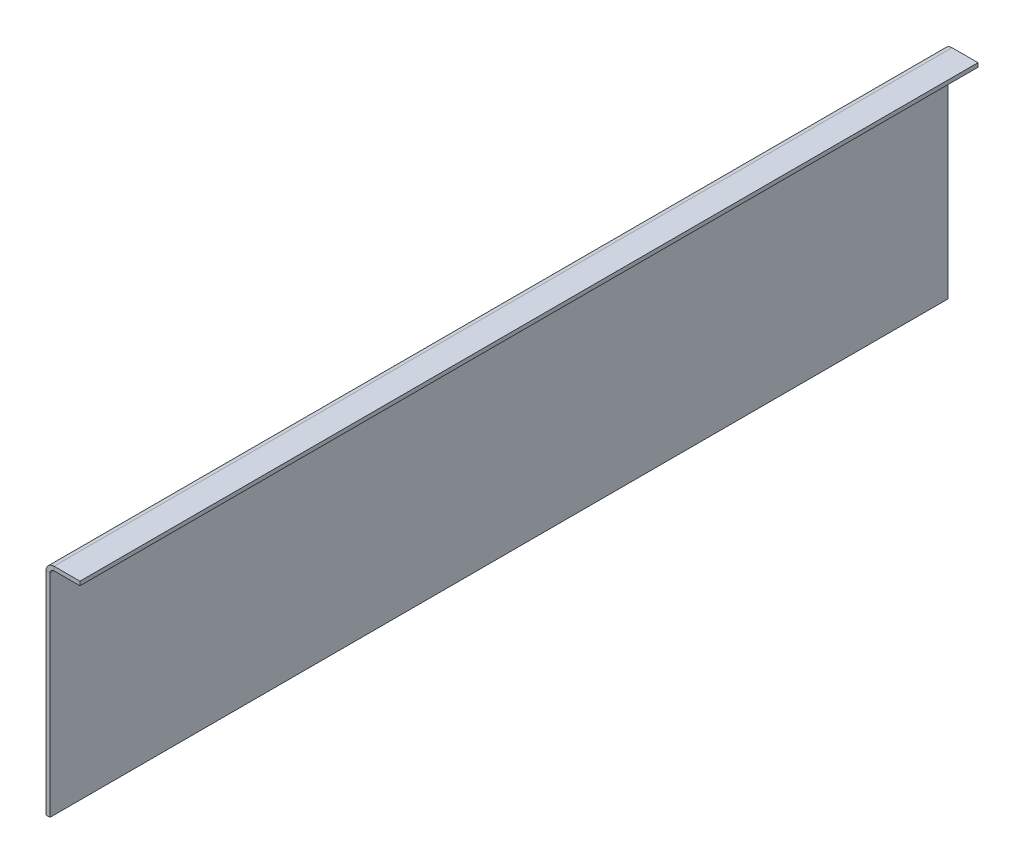
ISO-10303-21;
HEADER;
FILE_DESCRIPTION(('STEP AP214'),'2;1');
FILE_NAME('part.step','',(''),(''),'','','');
FILE_SCHEMA(('AUTOMOTIVE_DESIGN { 1 0 10303 214 1 1 1 1 }'));
ENDSEC;
DATA;
#1=APPLICATION_CONTEXT('core data for automotive mechanical design processes');
#2=APPLICATION_PROTOCOL_DEFINITION('international standard','automotive_design',2000,#1);
#3=PRODUCT_CONTEXT('',#1,'mechanical');
#4=PRODUCT('Part','Part','',(#3));
#5=PRODUCT_RELATED_PRODUCT_CATEGORY('part','',(#4));
#6=PRODUCT_DEFINITION_FORMATION('','',#4);
#7=PRODUCT_DEFINITION_CONTEXT('part definition',#1,'design');
#8=PRODUCT_DEFINITION('design','',#6,#7);
#9=PRODUCT_DEFINITION_SHAPE('','',#8);
#10=(LENGTH_UNIT() NAMED_UNIT(*) SI_UNIT(.MILLI.,.METRE.));
#11=(NAMED_UNIT(*) PLANE_ANGLE_UNIT() SI_UNIT($,.RADIAN.));
#12=(NAMED_UNIT(*) SI_UNIT($,.STERADIAN.) SOLID_ANGLE_UNIT());
#13=UNCERTAINTY_MEASURE_WITH_UNIT(LENGTH_MEASURE(1.E-05),#10,'distance_accuracy_value','');
#14=(GEOMETRIC_REPRESENTATION_CONTEXT(3) GLOBAL_UNCERTAINTY_ASSIGNED_CONTEXT((#13)) GLOBAL_UNIT_ASSIGNED_CONTEXT((#10,
#11,#12)) REPRESENTATION_CONTEXT('',''));
#15=CARTESIAN_POINT('',(0.,0.,0.));
#16=DIRECTION('',(0.,0.,1.));
#17=DIRECTION('',(1.,0.,0.));
#18=AXIS2_PLACEMENT_3D('',#15,#16,#17);
#19=CARTESIAN_POINT('',(17.,108.,-225.));
#20=DIRECTION('',(0.,0.,1.));
#21=DIRECTION('',(1.,0.,0.));
#22=AXIS2_PLACEMENT_3D('',#19,#20,#21);
#23=PLANE('',#22);
#24=DIRECTION('',(0.,-1.,0.));
#25=VECTOR('',#24,1.);
#26=CARTESIAN_POINT('',(3.99999999999998,108.,-225.));
#27=LINE('',#26,#25);
#28=CARTESIAN_POINT('',(3.99999999999998,110.,-225.));
#29=VERTEX_POINT('',#28);
#30=CARTESIAN_POINT('',(3.99999999999998,108.,-225.));
#31=VERTEX_POINT('',#30);
#32=EDGE_CURVE('E11',#29,#31,#27,.T.);
#33=ORIENTED_EDGE('',*,*,#32,.F.);
#34=DIRECTION('',(-1.,0.,0.));
#35=VECTOR('',#34,1.);
#36=CARTESIAN_POINT('',(17.,110.,-225.));
#37=LINE('',#36,#35);
#38=CARTESIAN_POINT('',(17.,110.,-225.));
#39=VERTEX_POINT('',#38);
#40=EDGE_CURVE('E95',#29,#39,#37,.F.);
#41=ORIENTED_EDGE('',*,*,#40,.T.);
#42=DIRECTION('',(0.,-1.,0.));
#43=VECTOR('',#42,1.);
#44=CARTESIAN_POINT('',(17.,108.,-225.));
#45=LINE('',#44,#43);
#46=CARTESIAN_POINT('',(17.,108.,-225.));
#47=VERTEX_POINT('',#46);
#48=EDGE_CURVE('E55',#39,#47,#45,.T.);
#49=ORIENTED_EDGE('',*,*,#48,.T.);
#50=DIRECTION('',(1.,0.,0.));
#51=VECTOR('',#50,1.);
#52=CARTESIAN_POINT('',(17.,108.,-225.));
#53=LINE('',#52,#51);
#54=EDGE_CURVE('E98',#31,#47,#53,.T.);
#55=ORIENTED_EDGE('',*,*,#54,.F.);
#56=EDGE_LOOP('',(#33,#41,#49,#55));
#57=FACE_BOUND('',#56,.T.);
#58=ADVANCED_FACE('F45',(#57),#23,.F.);
#59=CARTESIAN_POINT('',(17.,108.,225.));
#60=DIRECTION('',(1.,0.,0.));
#61=DIRECTION('',(0.,0.,-1.));
#62=AXIS2_PLACEMENT_3D('',#59,#60,#61);
#63=PLANE('',#62);
#64=ORIENTED_EDGE('',*,*,#48,.F.);
#65=DIRECTION('',(0.,0.,1.));
#66=VECTOR('',#65,1.);
#67=CARTESIAN_POINT('',(17.,110.,225.));
#68=LINE('',#67,#66);
#69=CARTESIAN_POINT('',(17.,110.,225.));
#70=VERTEX_POINT('',#69);
#71=EDGE_CURVE('E123',#70,#39,#68,.F.);
#72=ORIENTED_EDGE('',*,*,#71,.F.);
#73=DIRECTION('',(0.,-1.,0.));
#74=VECTOR('',#73,1.);
#75=CARTESIAN_POINT('',(17.,108.,225.));
#76=LINE('',#75,#74);
#77=CARTESIAN_POINT('',(17.,108.,225.));
#78=VERTEX_POINT('',#77);
#79=EDGE_CURVE('E141',#70,#78,#76,.T.);
#80=ORIENTED_EDGE('',*,*,#79,.T.);
#81=DIRECTION('',(0.,0.,-1.));
#82=VECTOR('',#81,1.);
#83=CARTESIAN_POINT('',(17.,108.,225.));
#84=LINE('',#83,#82);
#85=EDGE_CURVE('E152',#78,#47,#84,.T.);
#86=ORIENTED_EDGE('',*,*,#85,.T.);
#87=EDGE_LOOP('',(#64,#72,#80,#86));
#88=FACE_BOUND('',#87,.T.);
#89=ADVANCED_FACE('F158',(#88),#63,.T.);
#90=CARTESIAN_POINT('',(17.,108.,225.));
#91=DIRECTION('',(0.,0.,1.));
#92=DIRECTION('',(1.,0.,0.));
#93=AXIS2_PLACEMENT_3D('',#90,#91,#92);
#94=PLANE('',#93);
#95=ORIENTED_EDGE('',*,*,#79,.F.);
#96=DIRECTION('',(-1.,0.,0.));
#97=VECTOR('',#96,1.);
#98=CARTESIAN_POINT('',(17.,110.,225.));
#99=LINE('',#98,#97);
#100=CARTESIAN_POINT('',(3.99999999999998,110.,225.));
#101=VERTEX_POINT('',#100);
#102=EDGE_CURVE('E183',#101,#70,#99,.F.);
#103=ORIENTED_EDGE('',*,*,#102,.F.);
#104=DIRECTION('',(0.,-1.,0.));
#105=VECTOR('',#104,1.);
#106=CARTESIAN_POINT('',(3.99999999999998,108.,225.));
#107=LINE('',#106,#105);
#108=CARTESIAN_POINT('',(3.99999999999998,108.,225.));
#109=VERTEX_POINT('',#108);
#110=EDGE_CURVE('E138',#101,#109,#107,.T.);
#111=ORIENTED_EDGE('',*,*,#110,.T.);
#112=DIRECTION('',(1.,0.,0.));
#113=VECTOR('',#112,1.);
#114=CARTESIAN_POINT('',(17.,108.,225.));
#115=LINE('',#114,#113);
#116=EDGE_CURVE('E159',#109,#78,#115,.T.);
#117=ORIENTED_EDGE('',*,*,#116,.T.);
#118=EDGE_LOOP('',(#95,#103,#111,#117));
#119=FACE_BOUND('',#118,.T.);
#120=ADVANCED_FACE('F189',(#119),#94,.T.);
#121=CARTESIAN_POINT('',(3.99999999999999,106.,225.));
#122=DIRECTION('',(0.,0.,1.));
#123=DIRECTION('',(1.,0.,0.));
#124=AXIS2_PLACEMENT_3D('',#121,#122,#123);
#125=PLANE('',#124);
#126=ORIENTED_EDGE('',*,*,#110,.F.);
#127=CARTESIAN_POINT('',(3.99999999999999,106.,225.));
#128=DIRECTION('',(0.,0.,1.));
#129=DIRECTION('',(1.,0.,0.));
#130=AXIS2_PLACEMENT_3D('',#127,#128,#129);
#131=CIRCLE('',#130,4.);
#132=CARTESIAN_POINT('',(0.,106.,225.));
#133=VERTEX_POINT('',#132);
#134=EDGE_CURVE('E113',#101,#133,#131,.T.);
#135=ORIENTED_EDGE('',*,*,#134,.T.);
#136=DIRECTION('',(1.,0.,0.));
#137=VECTOR('',#136,1.);
#138=CARTESIAN_POINT('',(1.99999999999999,106.,225.));
#139=LINE('',#138,#137);
#140=CARTESIAN_POINT('',(1.99999999999999,106.,225.));
#141=VERTEX_POINT('',#140);
#142=EDGE_CURVE('E63',#133,#141,#139,.T.);
#143=ORIENTED_EDGE('',*,*,#142,.T.);
#144=CARTESIAN_POINT('',(3.99999999999999,106.,225.));
#145=DIRECTION('',(0.,0.,-1.));
#146=DIRECTION('',(-1.,0.,0.));
#147=AXIS2_PLACEMENT_3D('',#144,#145,#146);
#148=CIRCLE('',#147,2.);
#149=EDGE_CURVE('E156',#109,#141,#148,.F.);
#150=ORIENTED_EDGE('',*,*,#149,.F.);
#151=EDGE_LOOP('',(#126,#135,#143,#150));
#152=FACE_BOUND('',#151,.T.);
#153=ADVANCED_FACE('F192',(#152),#125,.T.);
#154=CARTESIAN_POINT('',(1.99999999999999,108.,225.));
#155=DIRECTION('',(0.,0.,1.));
#156=DIRECTION('',(0.,1.,0.));
#157=AXIS2_PLACEMENT_3D('',#154,#155,#156);
#158=PLANE('',#157);
#159=ORIENTED_EDGE('',*,*,#142,.F.);
#160=DIRECTION('',(0.,-1.,0.));
#161=VECTOR('',#160,1.);
#162=CARTESIAN_POINT('',(0.,108.,225.));
#163=LINE('',#162,#161);
#164=CARTESIAN_POINT('',(0.,0.,225.));
#165=VERTEX_POINT('',#164);
#166=EDGE_CURVE('E182',#165,#133,#163,.F.);
#167=ORIENTED_EDGE('',*,*,#166,.F.);
#168=DIRECTION('',(1.,0.,0.));
#169=VECTOR('',#168,1.);
#170=CARTESIAN_POINT('',(1.99999999999991,0.,225.));
#171=LINE('',#170,#169);
#172=CARTESIAN_POINT('',(1.99999999999991,0.,225.));
#173=VERTEX_POINT('',#172);
#174=EDGE_CURVE('E134',#165,#173,#171,.T.);
#175=ORIENTED_EDGE('',*,*,#174,.T.);
#176=DIRECTION('',(0.,1.,0.));
#177=VECTOR('',#176,1.);
#178=CARTESIAN_POINT('',(1.99999999999999,108.,225.));
#179=LINE('',#178,#177);
#180=EDGE_CURVE('E166',#173,#141,#179,.T.);
#181=ORIENTED_EDGE('',*,*,#180,.T.);
#182=EDGE_LOOP('',(#159,#167,#175,#181));
#183=FACE_BOUND('',#182,.T.);
#184=ADVANCED_FACE('F203',(#183),#158,.T.);
#185=CARTESIAN_POINT('',(1.99999999999991,0.,225.));
#186=DIRECTION('',(0.,1.,0.));
#187=DIRECTION('',(0.,0.,-1.));
#188=AXIS2_PLACEMENT_3D('',#185,#186,#187);
#189=PLANE('',#188);
#190=ORIENTED_EDGE('',*,*,#174,.F.);
#191=DIRECTION('',(0.,0.,1.));
#192=VECTOR('',#191,1.);
#193=CARTESIAN_POINT('',(0.,0.,225.));
#194=LINE('',#193,#192);
#195=CARTESIAN_POINT('',(0.,0.,-225.));
#196=VERTEX_POINT('',#195);
#197=EDGE_CURVE('E118',#165,#196,#194,.F.);
#198=ORIENTED_EDGE('',*,*,#197,.T.);
#199=DIRECTION('',(1.,0.,0.));
#200=VECTOR('',#199,1.);
#201=CARTESIAN_POINT('',(1.99999999999991,0.,-225.));
#202=LINE('',#201,#200);
#203=CARTESIAN_POINT('',(1.99999999999991,0.,-225.));
#204=VERTEX_POINT('',#203);
#205=EDGE_CURVE('E131',#196,#204,#202,.T.);
#206=ORIENTED_EDGE('',*,*,#205,.T.);
#207=DIRECTION('',(0.,0.,-1.));
#208=VECTOR('',#207,1.);
#209=CARTESIAN_POINT('',(1.99999999999991,0.,225.));
#210=LINE('',#209,#208);
#211=EDGE_CURVE('E169',#173,#204,#210,.T.);
#212=ORIENTED_EDGE('',*,*,#211,.F.);
#213=EDGE_LOOP('',(#190,#198,#206,#212));
#214=FACE_BOUND('',#213,.T.);
#215=ADVANCED_FACE('F209',(#214),#189,.F.);
#216=CARTESIAN_POINT('',(1.99999999999999,108.,-225.));
#217=DIRECTION('',(0.,0.,1.));
#218=DIRECTION('',(0.,1.,0.));
#219=AXIS2_PLACEMENT_3D('',#216,#217,#218);
#220=PLANE('',#219);
#221=ORIENTED_EDGE('',*,*,#205,.F.);
#222=DIRECTION('',(0.,-1.,0.));
#223=VECTOR('',#222,1.);
#224=CARTESIAN_POINT('',(0.,108.,-225.));
#225=LINE('',#224,#223);
#226=CARTESIAN_POINT('',(0.,106.,-225.));
#227=VERTEX_POINT('',#226);
#228=EDGE_CURVE('E180',#196,#227,#225,.F.);
#229=ORIENTED_EDGE('',*,*,#228,.T.);
#230=DIRECTION('',(1.,0.,0.));
#231=VECTOR('',#230,1.);
#232=CARTESIAN_POINT('',(1.99999999999999,106.,-225.));
#233=LINE('',#232,#231);
#234=CARTESIAN_POINT('',(1.99999999999999,106.,-225.));
#235=VERTEX_POINT('',#234);
#236=EDGE_CURVE('E49',#227,#235,#233,.T.);
#237=ORIENTED_EDGE('',*,*,#236,.T.);
#238=DIRECTION('',(0.,1.,0.));
#239=VECTOR('',#238,1.);
#240=CARTESIAN_POINT('',(1.99999999999999,108.,-225.));
#241=LINE('',#240,#239);
#242=EDGE_CURVE('E161',#204,#235,#241,.T.);
#243=ORIENTED_EDGE('',*,*,#242,.F.);
#244=EDGE_LOOP('',(#221,#229,#237,#243));
#245=FACE_BOUND('',#244,.T.);
#246=ADVANCED_FACE('F213',(#245),#220,.F.);
#247=CARTESIAN_POINT('',(3.99999999999999,106.,-225.));
#248=DIRECTION('',(0.,0.,-1.));
#249=DIRECTION('',(-1.,0.,0.));
#250=AXIS2_PLACEMENT_3D('',#247,#248,#249);
#251=PLANE('',#250);
#252=CARTESIAN_POINT('',(3.99999999999999,106.,-225.));
#253=DIRECTION('',(0.,0.,1.));
#254=DIRECTION('',(1.,0.,0.));
#255=AXIS2_PLACEMENT_3D('',#252,#253,#254);
#256=CIRCLE('',#255,4.);
#257=EDGE_CURVE('E111',#227,#29,#256,.F.);
#258=ORIENTED_EDGE('',*,*,#257,.T.);
#259=ORIENTED_EDGE('',*,*,#32,.T.);
#260=CARTESIAN_POINT('',(3.99999999999999,106.,-225.));
#261=DIRECTION('',(0.,0.,1.));
#262=DIRECTION('',(1.,0.,0.));
#263=AXIS2_PLACEMENT_3D('',#260,#261,#262);
#264=CIRCLE('',#263,2.);
#265=EDGE_CURVE('E176',#235,#31,#264,.F.);
#266=ORIENTED_EDGE('',*,*,#265,.F.);
#267=ORIENTED_EDGE('',*,*,#236,.F.);
#268=EDGE_LOOP('',(#258,#259,#266,#267));
#269=FACE_BOUND('',#268,.T.);
#270=ADVANCED_FACE('F47',(#269),#251,.T.);
#271=CARTESIAN_POINT('',(1.99999999999999,108.,225.));
#272=DIRECTION('',(-1.,0.,0.));
#273=DIRECTION('',(0.,-1.,0.));
#274=AXIS2_PLACEMENT_3D('',#271,#272,#273);
#275=PLANE('',#274);
#276=ORIENTED_EDGE('',*,*,#242,.T.);
#277=DIRECTION('',(0.,0.,-1.));
#278=VECTOR('',#277,1.);
#279=CARTESIAN_POINT('',(1.99999999999999,106.,225.));
#280=LINE('',#279,#278);
#281=EDGE_CURVE('E173',#235,#141,#280,.F.);
#282=ORIENTED_EDGE('',*,*,#281,.T.);
#283=ORIENTED_EDGE('',*,*,#180,.F.);
#284=ORIENTED_EDGE('',*,*,#211,.T.);
#285=EDGE_LOOP('',(#276,#282,#283,#284));
#286=FACE_BOUND('',#285,.T.);
#287=ADVANCED_FACE('F208',(#286),#275,.F.);
#288=CARTESIAN_POINT('',(17.,108.,225.));
#289=DIRECTION('',(0.,1.,0.));
#290=DIRECTION('',(-1.,0.,0.));
#291=AXIS2_PLACEMENT_3D('',#288,#289,#290);
#292=PLANE('',#291);
#293=ORIENTED_EDGE('',*,*,#116,.F.);
#294=DIRECTION('',(0.,0.,-1.));
#295=VECTOR('',#294,1.);
#296=CARTESIAN_POINT('',(3.99999999999998,108.,-225.));
#297=LINE('',#296,#295);
#298=EDGE_CURVE('E155',#109,#31,#297,.T.);
#299=ORIENTED_EDGE('',*,*,#298,.T.);
#300=ORIENTED_EDGE('',*,*,#54,.T.);
#301=ORIENTED_EDGE('',*,*,#85,.F.);
#302=EDGE_LOOP('',(#293,#299,#300,#301));
#303=FACE_BOUND('',#302,.T.);
#304=ADVANCED_FACE('F151',(#303),#292,.F.);
#305=CARTESIAN_POINT('',(3.99999999999999,106.,225.));
#306=DIRECTION('',(0.,0.,1.));
#307=DIRECTION('',(1.,0.,0.));
#308=AXIS2_PLACEMENT_3D('',#305,#306,#307);
#309=CYLINDRICAL_SURFACE('',#308,2.);
#310=ORIENTED_EDGE('',*,*,#149,.T.);
#311=ORIENTED_EDGE('',*,*,#281,.F.);
#312=ORIENTED_EDGE('',*,*,#265,.T.);
#313=ORIENTED_EDGE('',*,*,#298,.F.);
#314=EDGE_LOOP('',(#310,#311,#312,#313));
#315=FACE_BOUND('',#314,.T.);
#316=ADVANCED_FACE('F195',(#315),#309,.F.);
#317=CARTESIAN_POINT('',(0.,108.,225.));
#318=DIRECTION('',(-1.,0.,0.));
#319=DIRECTION('',(0.,-1.,0.));
#320=AXIS2_PLACEMENT_3D('',#317,#318,#319);
#321=PLANE('',#320);
#322=ORIENTED_EDGE('',*,*,#228,.F.);
#323=ORIENTED_EDGE('',*,*,#197,.F.);
#324=ORIENTED_EDGE('',*,*,#166,.T.);
#325=DIRECTION('',(0.,0.,1.));
#326=VECTOR('',#325,1.);
#327=CARTESIAN_POINT('',(0.,106.,225.));
#328=LINE('',#327,#326);
#329=EDGE_CURVE('E117',#227,#133,#328,.T.);
#330=ORIENTED_EDGE('',*,*,#329,.F.);
#331=EDGE_LOOP('',(#322,#323,#324,#330));
#332=FACE_BOUND('',#331,.T.);
#333=ADVANCED_FACE('F215',(#332),#321,.T.);
#334=CARTESIAN_POINT('',(17.,110.,225.));
#335=DIRECTION('',(0.,1.,0.));
#336=DIRECTION('',(-1.,0.,0.));
#337=AXIS2_PLACEMENT_3D('',#334,#335,#336);
#338=PLANE('',#337);
#339=ORIENTED_EDGE('',*,*,#102,.T.);
#340=ORIENTED_EDGE('',*,*,#71,.T.);
#341=ORIENTED_EDGE('',*,*,#40,.F.);
#342=DIRECTION('',(0.,0.,1.));
#343=VECTOR('',#342,1.);
#344=CARTESIAN_POINT('',(3.99999999999998,110.,225.));
#345=LINE('',#344,#343);
#346=EDGE_CURVE('E108',#101,#29,#345,.F.);
#347=ORIENTED_EDGE('',*,*,#346,.F.);
#348=EDGE_LOOP('',(#339,#340,#341,#347));
#349=FACE_BOUND('',#348,.T.);
#350=ADVANCED_FACE('F121',(#349),#338,.T.);
#351=CARTESIAN_POINT('',(3.99999999999999,106.,225.));
#352=DIRECTION('',(0.,0.,1.));
#353=DIRECTION('',(1.,0.,0.));
#354=AXIS2_PLACEMENT_3D('',#351,#352,#353);
#355=CYLINDRICAL_SURFACE('',#354,4.);
#356=ORIENTED_EDGE('',*,*,#134,.F.);
#357=ORIENTED_EDGE('',*,*,#346,.T.);
#358=ORIENTED_EDGE('',*,*,#257,.F.);
#359=ORIENTED_EDGE('',*,*,#329,.T.);
#360=EDGE_LOOP('',(#356,#357,#358,#359));
#361=FACE_BOUND('',#360,.T.);
#362=ADVANCED_FACE('F109',(#361),#355,.T.);
#363=CLOSED_SHELL('',(#58,#89,#120,#153,#184,#215,#246,#270,#287,#304,#316,#333,#350,#362));
#364=MANIFOLD_SOLID_BREP('B2',#363);
#365=ADVANCED_BREP_SHAPE_REPRESENTATION('',(#18,#364),#14);
#366=SHAPE_DEFINITION_REPRESENTATION(#9,#365);
ENDSEC;
END-ISO-10303-21;
